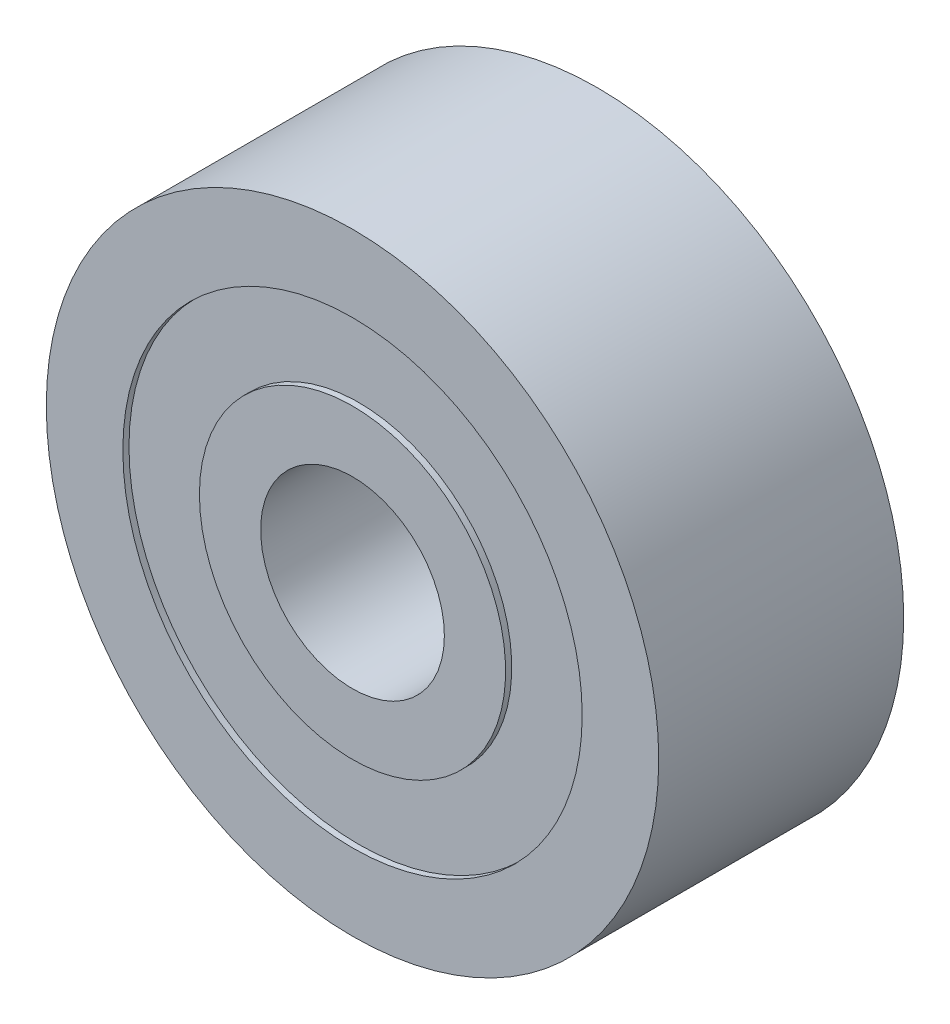
ISO-10303-21;
HEADER;
FILE_DESCRIPTION(('STEP AP214'),'2;1');
FILE_NAME('part.step','',(''),(''),'','','');
FILE_SCHEMA(('AUTOMOTIVE_DESIGN { 1 0 10303 214 1 1 1 1 }'));
ENDSEC;
DATA;
#1=APPLICATION_CONTEXT('core data for automotive mechanical design processes');
#2=APPLICATION_PROTOCOL_DEFINITION('international standard','automotive_design',2000,#1);
#3=PRODUCT_CONTEXT('',#1,'mechanical');
#4=PRODUCT('Part','Part','',(#3));
#5=PRODUCT_RELATED_PRODUCT_CATEGORY('part','',(#4));
#6=PRODUCT_DEFINITION_FORMATION('','',#4);
#7=PRODUCT_DEFINITION_CONTEXT('part definition',#1,'design');
#8=PRODUCT_DEFINITION('design','',#6,#7);
#9=PRODUCT_DEFINITION_SHAPE('','',#8);
#10=(LENGTH_UNIT() NAMED_UNIT(*) SI_UNIT(.MILLI.,.METRE.));
#11=(NAMED_UNIT(*) PLANE_ANGLE_UNIT() SI_UNIT($,.RADIAN.));
#12=(NAMED_UNIT(*) SI_UNIT($,.STERADIAN.) SOLID_ANGLE_UNIT());
#13=UNCERTAINTY_MEASURE_WITH_UNIT(LENGTH_MEASURE(1.E-05),#10,'distance_accuracy_value','');
#14=(GEOMETRIC_REPRESENTATION_CONTEXT(3) GLOBAL_UNCERTAINTY_ASSIGNED_CONTEXT((#13)) GLOBAL_UNIT_ASSIGNED_CONTEXT((#10,
#11,#12)) REPRESENTATION_CONTEXT('',''));
#15=CARTESIAN_POINT('',(0.,0.,0.));
#16=DIRECTION('',(0.,0.,1.));
#17=DIRECTION('',(1.,0.,0.));
#18=AXIS2_PLACEMENT_3D('',#15,#16,#17);
#19=CARTESIAN_POINT('',(0.,0.,0.));
#20=DIRECTION('',(0.,0.,1.));
#21=DIRECTION('',(1.,0.,0.));
#22=AXIS2_PLACEMENT_3D('',#19,#20,#21);
#23=CYLINDRICAL_SURFACE('',#22,1.5);
#24=CARTESIAN_POINT('',(0.,0.,2.));
#25=DIRECTION('',(0.,0.,1.));
#26=DIRECTION('',(1.,0.,0.));
#27=AXIS2_PLACEMENT_3D('',#24,#25,#26);
#28=CIRCLE('',#27,1.5);
#29=CARTESIAN_POINT('',(1.5,0.,2.));
#30=VERTEX_POINT('',#29);
#31=EDGE_CURVE('E51',#30,#30,#28,.F.);
#32=ORIENTED_EDGE('',*,*,#31,.F.);
#33=EDGE_LOOP('',(#32));
#34=FACE_BOUND('',#33,.T.);
#35=CARTESIAN_POINT('',(0.,0.,-2.));
#36=DIRECTION('',(0.,0.,1.));
#37=DIRECTION('',(1.,0.,0.));
#38=AXIS2_PLACEMENT_3D('',#35,#36,#37);
#39=CIRCLE('',#38,1.5);
#40=CARTESIAN_POINT('',(1.5,0.,-2.));
#41=VERTEX_POINT('',#40);
#42=EDGE_CURVE('E17',#41,#41,#39,.F.);
#43=ORIENTED_EDGE('',*,*,#42,.T.);
#44=EDGE_LOOP('',(#43));
#45=FACE_BOUND('',#44,.T.);
#46=ADVANCED_FACE('F14',(#34,#45),#23,.F.);
#47=CARTESIAN_POINT('',(0.,0.,-2.));
#48=DIRECTION('',(0.,0.,1.));
#49=DIRECTION('',(1.,0.,0.));
#50=AXIS2_PLACEMENT_3D('',#47,#48,#49);
#51=PLANE('',#50);
#52=ORIENTED_EDGE('',*,*,#42,.F.);
#53=EDGE_LOOP('',(#52));
#54=FACE_BOUND('',#53,.T.);
#55=CARTESIAN_POINT('',(0.,0.,-2.));
#56=DIRECTION('',(0.,0.,-1.));
#57=DIRECTION('',(-1.,0.,0.));
#58=AXIS2_PLACEMENT_3D('',#55,#56,#57);
#59=CIRCLE('',#58,2.5);
#60=CARTESIAN_POINT('',(-2.5,0.,-2.));
#61=VERTEX_POINT('',#60);
#62=EDGE_CURVE('E49',#61,#61,#59,.F.);
#63=ORIENTED_EDGE('',*,*,#62,.F.);
#64=EDGE_LOOP('',(#63));
#65=FACE_BOUND('',#64,.T.);
#66=ADVANCED_FACE('F59',(#54,#65),#51,.F.);
#67=CARTESIAN_POINT('',(0.,0.,2.));
#68=DIRECTION('',(0.,0.,1.));
#69=DIRECTION('',(1.,0.,0.));
#70=AXIS2_PLACEMENT_3D('',#67,#68,#69);
#71=PLANE('',#70);
#72=ORIENTED_EDGE('',*,*,#31,.T.);
#73=EDGE_LOOP('',(#72));
#74=FACE_BOUND('',#73,.T.);
#75=CARTESIAN_POINT('',(0.,0.,2.));
#76=DIRECTION('',(0.,0.,-1.));
#77=DIRECTION('',(-1.,0.,0.));
#78=AXIS2_PLACEMENT_3D('',#75,#76,#77);
#79=CIRCLE('',#78,2.5);
#80=CARTESIAN_POINT('',(-2.5,0.,2.));
#81=VERTEX_POINT('',#80);
#82=EDGE_CURVE('E46',#81,#81,#79,.T.);
#83=ORIENTED_EDGE('',*,*,#82,.F.);
#84=EDGE_LOOP('',(#83));
#85=FACE_BOUND('',#84,.T.);
#86=ADVANCED_FACE('F62',(#74,#85),#71,.T.);
#87=CARTESIAN_POINT('',(0.,0.,-2.));
#88=DIRECTION('',(0.,0.,-1.));
#89=DIRECTION('',(-1.,0.,0.));
#90=AXIS2_PLACEMENT_3D('',#87,#88,#89);
#91=CYLINDRICAL_SURFACE('',#90,2.5);
#92=ORIENTED_EDGE('',*,*,#62,.T.);
#93=EDGE_LOOP('',(#92));
#94=FACE_BOUND('',#93,.T.);
#95=CARTESIAN_POINT('',(0.,0.,-1.9));
#96=DIRECTION('',(0.,0.,-1.));
#97=DIRECTION('',(-1.,0.,0.));
#98=AXIS2_PLACEMENT_3D('',#95,#96,#97);
#99=CIRCLE('',#98,2.5);
#100=CARTESIAN_POINT('',(-2.5,0.,-1.9));
#101=VERTEX_POINT('',#100);
#102=EDGE_CURVE('E43',#101,#101,#99,.T.);
#103=ORIENTED_EDGE('',*,*,#102,.T.);
#104=EDGE_LOOP('',(#103));
#105=FACE_BOUND('',#104,.T.);
#106=ADVANCED_FACE('F65',(#94,#105),#91,.T.);
#107=CARTESIAN_POINT('',(0.,0.,2.));
#108=DIRECTION('',(0.,0.,-1.));
#109=DIRECTION('',(-1.,0.,0.));
#110=AXIS2_PLACEMENT_3D('',#107,#108,#109);
#111=CYLINDRICAL_SURFACE('',#110,2.5);
#112=ORIENTED_EDGE('',*,*,#82,.T.);
#113=EDGE_LOOP('',(#112));
#114=FACE_BOUND('',#113,.T.);
#115=CARTESIAN_POINT('',(0.,0.,1.9));
#116=DIRECTION('',(0.,0.,-1.));
#117=DIRECTION('',(-1.,0.,0.));
#118=AXIS2_PLACEMENT_3D('',#115,#116,#117);
#119=CIRCLE('',#118,2.5);
#120=CARTESIAN_POINT('',(-2.5,0.,1.9));
#121=VERTEX_POINT('',#120);
#122=EDGE_CURVE('E40',#121,#121,#119,.T.);
#123=ORIENTED_EDGE('',*,*,#122,.F.);
#124=EDGE_LOOP('',(#123));
#125=FACE_BOUND('',#124,.T.);
#126=ADVANCED_FACE('F68',(#114,#125),#111,.T.);
#127=CARTESIAN_POINT('',(0.,0.,-1.9));
#128=DIRECTION('',(0.,0.,1.));
#129=DIRECTION('',(1.,0.,0.));
#130=AXIS2_PLACEMENT_3D('',#127,#128,#129);
#131=PLANE('',#130);
#132=ORIENTED_EDGE('',*,*,#102,.F.);
#133=EDGE_LOOP('',(#132));
#134=FACE_BOUND('',#133,.T.);
#135=CARTESIAN_POINT('',(0.,0.,-1.9));
#136=DIRECTION('',(0.,0.,-1.));
#137=DIRECTION('',(-1.,0.,0.));
#138=AXIS2_PLACEMENT_3D('',#135,#136,#137);
#139=CIRCLE('',#138,3.75);
#140=CARTESIAN_POINT('',(-3.75,0.,-1.9));
#141=VERTEX_POINT('',#140);
#142=EDGE_CURVE('E37',#141,#141,#139,.T.);
#143=ORIENTED_EDGE('',*,*,#142,.T.);
#144=EDGE_LOOP('',(#143));
#145=FACE_BOUND('',#144,.T.);
#146=ADVANCED_FACE('F72',(#134,#145),#131,.F.);
#147=CARTESIAN_POINT('',(0.,0.,1.9));
#148=DIRECTION('',(0.,0.,1.));
#149=DIRECTION('',(1.,0.,0.));
#150=AXIS2_PLACEMENT_3D('',#147,#148,#149);
#151=PLANE('',#150);
#152=ORIENTED_EDGE('',*,*,#122,.T.);
#153=EDGE_LOOP('',(#152));
#154=FACE_BOUND('',#153,.T.);
#155=CARTESIAN_POINT('',(0.,0.,1.9));
#156=DIRECTION('',(0.,0.,-1.));
#157=DIRECTION('',(-1.,0.,0.));
#158=AXIS2_PLACEMENT_3D('',#155,#156,#157);
#159=CIRCLE('',#158,3.75);
#160=CARTESIAN_POINT('',(-3.75,0.,1.9));
#161=VERTEX_POINT('',#160);
#162=EDGE_CURVE('E34',#161,#161,#159,.F.);
#163=ORIENTED_EDGE('',*,*,#162,.T.);
#164=EDGE_LOOP('',(#163));
#165=FACE_BOUND('',#164,.T.);
#166=ADVANCED_FACE('F75',(#154,#165),#151,.T.);
#167=CARTESIAN_POINT('',(0.,0.,-2.));
#168=DIRECTION('',(0.,0.,-1.));
#169=DIRECTION('',(-1.,0.,0.));
#170=AXIS2_PLACEMENT_3D('',#167,#168,#169);
#171=CYLINDRICAL_SURFACE('',#170,3.75);
#172=CARTESIAN_POINT('',(0.,0.,-2.));
#173=DIRECTION('',(0.,0.,-1.));
#174=DIRECTION('',(-1.,0.,0.));
#175=AXIS2_PLACEMENT_3D('',#172,#173,#174);
#176=CIRCLE('',#175,3.75);
#177=CARTESIAN_POINT('',(-3.75,0.,-2.));
#178=VERTEX_POINT('',#177);
#179=EDGE_CURVE('E31',#178,#178,#176,.T.);
#180=ORIENTED_EDGE('',*,*,#179,.T.);
#181=EDGE_LOOP('',(#180));
#182=FACE_BOUND('',#181,.T.);
#183=ORIENTED_EDGE('',*,*,#142,.F.);
#184=EDGE_LOOP('',(#183));
#185=FACE_BOUND('',#184,.T.);
#186=ADVANCED_FACE('F79',(#182,#185),#171,.F.);
#187=CARTESIAN_POINT('',(0.,0.,2.));
#188=DIRECTION('',(0.,0.,-1.));
#189=DIRECTION('',(-1.,0.,0.));
#190=AXIS2_PLACEMENT_3D('',#187,#188,#189);
#191=CYLINDRICAL_SURFACE('',#190,3.75);
#192=CARTESIAN_POINT('',(0.,0.,2.));
#193=DIRECTION('',(0.,0.,-1.));
#194=DIRECTION('',(-1.,0.,0.));
#195=AXIS2_PLACEMENT_3D('',#192,#193,#194);
#196=CIRCLE('',#195,3.75);
#197=CARTESIAN_POINT('',(-3.75,0.,2.));
#198=VERTEX_POINT('',#197);
#199=EDGE_CURVE('E26',#198,#198,#196,.T.);
#200=ORIENTED_EDGE('',*,*,#199,.F.);
#201=EDGE_LOOP('',(#200));
#202=FACE_BOUND('',#201,.T.);
#203=ORIENTED_EDGE('',*,*,#162,.F.);
#204=EDGE_LOOP('',(#203));
#205=FACE_BOUND('',#204,.T.);
#206=ADVANCED_FACE('F81',(#202,#205),#191,.F.);
#207=CARTESIAN_POINT('',(0.,0.,-2.));
#208=DIRECTION('',(0.,0.,1.));
#209=DIRECTION('',(1.,0.,0.));
#210=AXIS2_PLACEMENT_3D('',#207,#208,#209);
#211=PLANE('',#210);
#212=ORIENTED_EDGE('',*,*,#179,.F.);
#213=EDGE_LOOP('',(#212));
#214=FACE_BOUND('',#213,.T.);
#215=CARTESIAN_POINT('',(0.,0.,-2.));
#216=DIRECTION('',(0.,0.,1.));
#217=DIRECTION('',(1.,0.,0.));
#218=AXIS2_PLACEMENT_3D('',#215,#216,#217);
#219=CIRCLE('',#218,5.);
#220=CARTESIAN_POINT('',(5.,0.,-2.));
#221=VERTEX_POINT('',#220);
#222=EDGE_CURVE('E21',#221,#221,#219,.T.);
#223=ORIENTED_EDGE('',*,*,#222,.F.);
#224=EDGE_LOOP('',(#223));
#225=FACE_BOUND('',#224,.T.);
#226=ADVANCED_FACE('F89',(#214,#225),#211,.F.);
#227=CARTESIAN_POINT('',(0.,0.,2.));
#228=DIRECTION('',(0.,0.,1.));
#229=DIRECTION('',(1.,0.,0.));
#230=AXIS2_PLACEMENT_3D('',#227,#228,#229);
#231=PLANE('',#230);
#232=ORIENTED_EDGE('',*,*,#199,.T.);
#233=EDGE_LOOP('',(#232));
#234=FACE_BOUND('',#233,.T.);
#235=CARTESIAN_POINT('',(0.,0.,2.));
#236=DIRECTION('',(0.,0.,1.));
#237=DIRECTION('',(1.,0.,0.));
#238=AXIS2_PLACEMENT_3D('',#235,#236,#237);
#239=CIRCLE('',#238,5.);
#240=CARTESIAN_POINT('',(5.,0.,2.));
#241=VERTEX_POINT('',#240);
#242=EDGE_CURVE('E10',#241,#241,#239,.F.);
#243=ORIENTED_EDGE('',*,*,#242,.F.);
#244=EDGE_LOOP('',(#243));
#245=FACE_BOUND('',#244,.T.);
#246=ADVANCED_FACE('F96',(#234,#245),#231,.T.);
#247=CARTESIAN_POINT('',(0.,0.,0.));
#248=DIRECTION('',(0.,0.,1.));
#249=DIRECTION('',(1.,0.,0.));
#250=AXIS2_PLACEMENT_3D('',#247,#248,#249);
#251=CYLINDRICAL_SURFACE('',#250,5.);
#252=ORIENTED_EDGE('',*,*,#242,.T.);
#253=EDGE_LOOP('',(#252));
#254=FACE_BOUND('',#253,.T.);
#255=ORIENTED_EDGE('',*,*,#222,.T.);
#256=EDGE_LOOP('',(#255));
#257=FACE_BOUND('',#256,.T.);
#258=ADVANCED_FACE('F94',(#254,#257),#251,.T.);
#259=CLOSED_SHELL('',(#46,#66,#86,#106,#126,#146,#166,#186,#206,#226,#246,#258));
#260=MANIFOLD_SOLID_BREP('B1',#259);
#261=ADVANCED_BREP_SHAPE_REPRESENTATION('',(#18,#260),#14);
#262=SHAPE_DEFINITION_REPRESENTATION(#9,#261);
ENDSEC;
END-ISO-10303-21;
